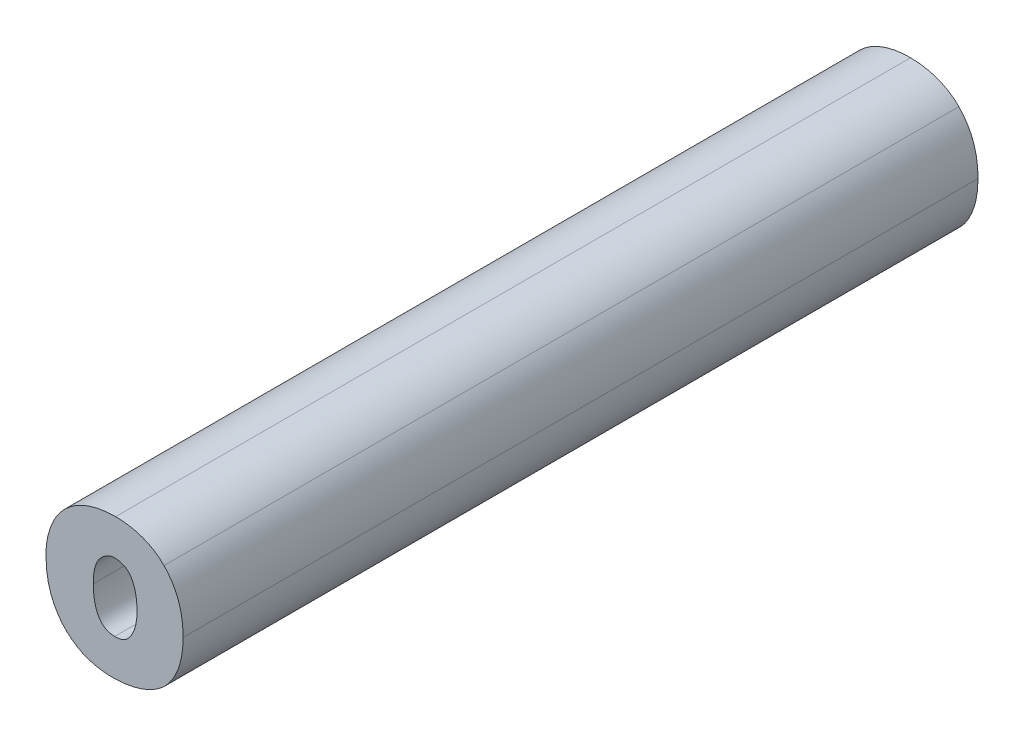
ISO-10303-21;
HEADER;
FILE_DESCRIPTION(('STEP AP214'),'2;1');
FILE_NAME('part.step','',(''),(''),'','','');
FILE_SCHEMA(('AUTOMOTIVE_DESIGN { 1 0 10303 214 1 1 1 1 }'));
ENDSEC;
DATA;
#1=APPLICATION_CONTEXT('core data for automotive mechanical design processes');
#2=APPLICATION_PROTOCOL_DEFINITION('international standard','automotive_design',2000,#1);
#3=PRODUCT_CONTEXT('',#1,'mechanical');
#4=PRODUCT('Part','Part','',(#3));
#5=PRODUCT_RELATED_PRODUCT_CATEGORY('part','',(#4));
#6=PRODUCT_DEFINITION_FORMATION('','',#4);
#7=PRODUCT_DEFINITION_CONTEXT('part definition',#1,'design');
#8=PRODUCT_DEFINITION('design','',#6,#7);
#9=PRODUCT_DEFINITION_SHAPE('','',#8);
#10=(LENGTH_UNIT() NAMED_UNIT(*) SI_UNIT(.MILLI.,.METRE.));
#11=(NAMED_UNIT(*) PLANE_ANGLE_UNIT() SI_UNIT($,.RADIAN.));
#12=(NAMED_UNIT(*) SI_UNIT($,.STERADIAN.) SOLID_ANGLE_UNIT());
#13=UNCERTAINTY_MEASURE_WITH_UNIT(LENGTH_MEASURE(1.E-05),#10,'distance_accuracy_value','');
#14=(GEOMETRIC_REPRESENTATION_CONTEXT(3) GLOBAL_UNCERTAINTY_ASSIGNED_CONTEXT((#13)) GLOBAL_UNIT_ASSIGNED_CONTEXT((#10,
#11,#12)) REPRESENTATION_CONTEXT('',''));
#15=CARTESIAN_POINT('',(0.,0.,0.));
#16=DIRECTION('',(0.,0.,1.));
#17=DIRECTION('',(1.,0.,0.));
#18=AXIS2_PLACEMENT_3D('',#15,#16,#17);
#19=CARTESIAN_POINT('',(1.3978509286736,0.0214916953246287,0.));
#20=CARTESIAN_POINT('',(1.3978509286736,0.0214916953246287,0.1));
#21=CARTESIAN_POINT('',(1.3985178231572,0.0214916953246297,0.));
#22=CARTESIAN_POINT('',(1.3985178231572,0.0214916953246297,0.1));
#23=CARTESIAN_POINT('',(1.3991557262079,0.0216656658089587,0.));
#24=CARTESIAN_POINT('',(1.3991557262079,0.0216656658089587,0.1));
#25=CARTESIAN_POINT('',(1.3995616679496,0.0221469920412952,0.));
#26=CARTESIAN_POINT('',(1.3995616679496,0.0221469920412952,0.1));
#27=B_SPLINE_SURFACE_WITH_KNOTS('',3,1,((#19,#20),(#21,#22),(#23,#24),(#25,#26)),.UNSPECIFIED.,
.F.,.F.,.F.,(4,4),(2,2),(-1.,0.),(0.,0.01),.UNSPECIFIED.);
#28=CARTESIAN_POINT('',(1.3978509286736,0.0214916953246287,0.));
#29=CARTESIAN_POINT('',(1.3985178231572,0.0214916953246297,0.));
#30=CARTESIAN_POINT('',(1.3991557262079,0.0216656658089587,0.));
#31=CARTESIAN_POINT('',(1.3995616679496,0.0221469920412952,0.));
#32=B_SPLINE_CURVE_WITH_KNOTS('',3,(#28,#29,#30,#31),.UNSPECIFIED.,.F.,.F.,(4,4),(-1.,0.),.UNSPECIFIED.);
#33=CARTESIAN_POINT('',(1.3978509286736,0.0214916953246287,0.));
#34=VERTEX_POINT('',#33);
#35=CARTESIAN_POINT('',(1.3995616679496,0.0221469920412952,0.));
#36=VERTEX_POINT('',#35);
#37=EDGE_CURVE('E11',#34,#36,#32,.T.);
#38=DIRECTION('',(0.,0.,1.));
#39=VECTOR('',#38,1.);
#40=CARTESIAN_POINT('',(1.3978509286736,0.0214916953246287,0.));
#41=LINE('',#40,#39);
#42=CARTESIAN_POINT('',(1.3978509286736,0.0214916953246287,0.1));
#43=VERTEX_POINT('',#42);
#44=EDGE_CURVE('E28',#34,#43,#41,.T.);
#45=CARTESIAN_POINT('',(1.3995616679496,0.0221469920412952,0.1));
#46=CARTESIAN_POINT('',(1.3991557262079,0.0216656658089587,0.1));
#47=CARTESIAN_POINT('',(1.3985178231572,0.0214916953246297,0.1));
#48=CARTESIAN_POINT('',(1.3978509286736,0.0214916953246287,0.1));
#49=B_SPLINE_CURVE_WITH_KNOTS('',3,(#45,#46,#47,#48),.UNSPECIFIED.,.F.,.F.,(4,4),(0.,1.),.UNSPECIFIED.);
#50=CARTESIAN_POINT('',(1.3995616679496,0.0221469920412952,0.1));
#51=VERTEX_POINT('',#50);
#52=EDGE_CURVE('E389',#51,#43,#49,.T.);
#53=DIRECTION('',(0.,0.,1.));
#54=VECTOR('',#53,1.);
#55=CARTESIAN_POINT('',(1.3995616679496,0.0221469920412952,0.));
#56=LINE('',#55,#54);
#57=EDGE_CURVE('E41',#36,#51,#56,.T.);
#58=ORIENTED_EDGE('',*,*,#37,.F.);
#59=ORIENTED_EDGE('',*,*,#44,.T.);
#60=ORIENTED_EDGE('',*,*,#52,.F.);
#61=ORIENTED_EDGE('',*,*,#57,.F.);
#62=EDGE_LOOP('',(#58,#59,#60,#61));
#63=FACE_BOUND('',#62,.T.);
#64=ADVANCED_FACE('F17',(#63),#27,.F.);
#65=CARTESIAN_POINT('',(1.3951543493576,0.0258787133476287,0.));
#66=CARTESIAN_POINT('',(1.3951543493576,0.0258787133476287,0.1));
#67=CARTESIAN_POINT('',(1.3951543493576,0.0242375686322922,0.));
#68=CARTESIAN_POINT('',(1.3951543493576,0.0242375686322922,0.1));
#69=CARTESIAN_POINT('',(1.3955312917076,0.0214916953246297,0.));
#70=CARTESIAN_POINT('',(1.3955312917076,0.0214916953246297,0.1));
#71=CARTESIAN_POINT('',(1.3978509286736,0.0214916953246287,0.));
#72=CARTESIAN_POINT('',(1.3978509286736,0.0214916953246287,0.1));
#73=B_SPLINE_SURFACE_WITH_KNOTS('',3,1,((#65,#66),(#67,#68),(#69,#70),(#71,#72)),.UNSPECIFIED.,
.F.,.F.,.F.,(4,4),(2,2),(-1.,0.),(0.,0.01),.UNSPECIFIED.);
#74=CARTESIAN_POINT('',(1.3951543493576,0.0258787133476287,0.));
#75=CARTESIAN_POINT('',(1.3951543493576,0.0242375686322922,0.));
#76=CARTESIAN_POINT('',(1.3955312917076,0.0214916953246297,0.));
#77=CARTESIAN_POINT('',(1.3978509286736,0.0214916953246287,0.));
#78=B_SPLINE_CURVE_WITH_KNOTS('',3,(#74,#75,#76,#77),.UNSPECIFIED.,.F.,.F.,(4,4),(-1.,0.),.UNSPECIFIED.);
#79=CARTESIAN_POINT('',(1.3951543493576,0.0258787133476287,0.));
#80=VERTEX_POINT('',#79);
#81=EDGE_CURVE('E380',#80,#34,#78,.T.);
#82=DIRECTION('',(0.,0.,1.));
#83=VECTOR('',#82,1.);
#84=CARTESIAN_POINT('',(1.3951543493576,0.0258787133476287,0.));
#85=LINE('',#84,#83);
#86=CARTESIAN_POINT('',(1.3951543493576,0.0258787133476287,0.1));
#87=VERTEX_POINT('',#86);
#88=EDGE_CURVE('E374',#80,#87,#85,.T.);
#89=CARTESIAN_POINT('',(1.3978509286736,0.0214916953246287,0.1));
#90=CARTESIAN_POINT('',(1.3955312917076,0.0214916953246297,0.1));
#91=CARTESIAN_POINT('',(1.3951543493576,0.0242375686322922,0.1));
#92=CARTESIAN_POINT('',(1.3951543493576,0.0258787133476287,0.1));
#93=B_SPLINE_CURVE_WITH_KNOTS('',3,(#89,#90,#91,#92),.UNSPECIFIED.,.F.,.F.,(4,4),(0.,1.),.UNSPECIFIED.);
#94=EDGE_CURVE('E367',#43,#87,#93,.T.);
#95=ORIENTED_EDGE('',*,*,#81,.F.);
#96=ORIENTED_EDGE('',*,*,#88,.T.);
#97=ORIENTED_EDGE('',*,*,#94,.F.);
#98=ORIENTED_EDGE('',*,*,#44,.F.);
#99=EDGE_LOOP('',(#95,#96,#97,#98));
#100=FACE_BOUND('',#99,.T.);
#101=ADVANCED_FACE('F395',(#100),#73,.F.);
#102=CARTESIAN_POINT('',(1.3964591449023,0.0295118546292952,0.));
#103=CARTESIAN_POINT('',(1.3964591449023,0.0295118546292952,0.1));
#104=CARTESIAN_POINT('',(1.3957052621918,0.0289000440672993,0.));
#105=CARTESIAN_POINT('',(1.3957052621918,0.0289000440672993,0.1));
#106=CARTESIAN_POINT('',(1.3951543493576,0.0279692899386336,0.));
#107=CARTESIAN_POINT('',(1.3951543493576,0.0279692899386336,0.1));
#108=CARTESIAN_POINT('',(1.3951543493576,0.0258787133476287,0.));
#109=CARTESIAN_POINT('',(1.3951543493576,0.0258787133476287,0.1));
#110=B_SPLINE_SURFACE_WITH_KNOTS('',3,1,((#102,#103),(#104,#105),(#106,#107),(#108,#109)),
.UNSPECIFIED.,.F.,.F.,.F.,(4,4),(2,2),(-1.,0.),(0.,0.01),.UNSPECIFIED.);
#111=CARTESIAN_POINT('',(1.3964591449023,0.0295118546292952,0.));
#112=CARTESIAN_POINT('',(1.3957052621918,0.0289000440672993,0.));
#113=CARTESIAN_POINT('',(1.3951543493576,0.0279692899386336,0.));
#114=CARTESIAN_POINT('',(1.3951543493576,0.0258787133476287,0.));
#115=B_SPLINE_CURVE_WITH_KNOTS('',3,(#111,#112,#113,#114),.UNSPECIFIED.,.F.,.F.,(4,4),(-1.,0.),.UNSPECIFIED.);
#116=CARTESIAN_POINT('',(1.3964591449023,0.0295118546292952,0.));
#117=VERTEX_POINT('',#116);
#118=EDGE_CURVE('E362',#117,#80,#115,.T.);
#119=DIRECTION('',(0.,0.,1.));
#120=VECTOR('',#119,1.);
#121=CARTESIAN_POINT('',(1.3964591449023,0.0295118546292952,0.));
#122=LINE('',#121,#120);
#123=CARTESIAN_POINT('',(1.3964591449023,0.0295118546292952,0.1));
#124=VERTEX_POINT('',#123);
#125=EDGE_CURVE('E356',#117,#124,#122,.T.);
#126=CARTESIAN_POINT('',(1.3951543493576,0.0258787133476287,0.1));
#127=CARTESIAN_POINT('',(1.3951543493576,0.0279692899386336,0.1));
#128=CARTESIAN_POINT('',(1.3957052621918,0.0289000440672993,0.1));
#129=CARTESIAN_POINT('',(1.3964591449023,0.0295118546292952,0.1));
#130=B_SPLINE_CURVE_WITH_KNOTS('',3,(#126,#127,#128,#129),.UNSPECIFIED.,.F.,.F.,(4,4),(0.,1.),.UNSPECIFIED.);
#131=EDGE_CURVE('E349',#87,#124,#130,.T.);
#132=ORIENTED_EDGE('',*,*,#118,.F.);
#133=ORIENTED_EDGE('',*,*,#125,.T.);
#134=ORIENTED_EDGE('',*,*,#131,.F.);
#135=ORIENTED_EDGE('',*,*,#88,.F.);
#136=EDGE_LOOP('',(#132,#133,#134,#135));
#137=FACE_BOUND('',#136,.T.);
#138=ADVANCED_FACE('F408',(#137),#110,.F.);
#139=CARTESIAN_POINT('',(1.3978799220963,0.0300598685192742,0.));
#140=CARTESIAN_POINT('',(1.3978799220963,0.0300598685192742,0.1));
#141=CARTESIAN_POINT('',(1.3971550427569,0.0300598685084712,0.));
#142=CARTESIAN_POINT('',(1.3971550427569,0.0300598685084712,0.1));
#143=CARTESIAN_POINT('',(1.3966331153928,0.0296394280580503,0.));
#144=CARTESIAN_POINT('',(1.3966331153928,0.0296394280580503,0.1));
#145=CARTESIAN_POINT('',(1.3964591449023,0.0295118546292952,0.));
#146=CARTESIAN_POINT('',(1.3964591449023,0.0295118546292952,0.1));
#147=B_SPLINE_SURFACE_WITH_KNOTS('',3,1,((#139,#140),(#141,#142),(#143,#144),(#145,#146)),
.UNSPECIFIED.,.F.,.F.,.F.,(4,4),(2,2),(-1.,0.),(0.,0.01),.UNSPECIFIED.);
#148=CARTESIAN_POINT('',(1.3978799220963,0.0300598685192742,0.));
#149=CARTESIAN_POINT('',(1.3971550427569,0.0300598685084712,0.));
#150=CARTESIAN_POINT('',(1.3966331153928,0.0296394280580503,0.));
#151=CARTESIAN_POINT('',(1.3964591449023,0.0295118546292952,0.));
#152=B_SPLINE_CURVE_WITH_KNOTS('',3,(#148,#149,#150,#151),.UNSPECIFIED.,.F.,.F.,(4,4),(-1.,0.),.UNSPECIFIED.);
#153=CARTESIAN_POINT('',(1.3978799220963,0.0300598685192742,0.));
#154=VERTEX_POINT('',#153);
#155=EDGE_CURVE('E344',#154,#117,#152,.T.);
#156=DIRECTION('',(0.,0.,1.));
#157=VECTOR('',#156,1.);
#158=CARTESIAN_POINT('',(1.3978799220963,0.0300598685192742,0.));
#159=LINE('',#158,#157);
#160=CARTESIAN_POINT('',(1.3978799220963,0.0300598685192742,0.1));
#161=VERTEX_POINT('',#160);
#162=EDGE_CURVE('E338',#154,#161,#159,.T.);
#163=CARTESIAN_POINT('',(1.3964591449023,0.0295118546292952,0.1));
#164=CARTESIAN_POINT('',(1.3966331153928,0.0296394280580503,0.1));
#165=CARTESIAN_POINT('',(1.3971550427569,0.0300598685084712,0.1));
#166=CARTESIAN_POINT('',(1.3978799220963,0.0300598685192742,0.1));
#167=B_SPLINE_CURVE_WITH_KNOTS('',3,(#163,#164,#165,#166),.UNSPECIFIED.,.F.,.F.,(4,4),(0.,1.),.UNSPECIFIED.);
#168=EDGE_CURVE('E331',#124,#161,#167,.T.);
#169=ORIENTED_EDGE('',*,*,#155,.F.);
#170=ORIENTED_EDGE('',*,*,#162,.T.);
#171=ORIENTED_EDGE('',*,*,#168,.F.);
#172=ORIENTED_EDGE('',*,*,#125,.F.);
#173=EDGE_LOOP('',(#169,#170,#171,#172));
#174=FACE_BOUND('',#173,.T.);
#175=ADVANCED_FACE('F411',(#174),#147,.F.);
#176=CARTESIAN_POINT('',(1.3995616679496,0.0294393651036287,0.));
#177=CARTESIAN_POINT('',(1.3995616679496,0.0294393651036287,0.1));
#178=CARTESIAN_POINT('',(1.3990107531256,0.0299554806576282,0.));
#179=CARTESIAN_POINT('',(1.3990107531256,0.0299554806576282,0.1));
#180=CARTESIAN_POINT('',(1.3981698782092,0.0300598685192728,0.));
#181=CARTESIAN_POINT('',(1.3981698782092,0.0300598685192728,0.1));
#182=CARTESIAN_POINT('',(1.3978799220963,0.0300598685192742,0.));
#183=CARTESIAN_POINT('',(1.3978799220963,0.0300598685192742,0.1));
#184=B_SPLINE_SURFACE_WITH_KNOTS('',3,1,((#176,#177),(#178,#179),(#180,#181),(#182,#183)),
.UNSPECIFIED.,.F.,.F.,.F.,(4,4),(2,2),(-1.,0.),(0.,0.01),.UNSPECIFIED.);
#185=CARTESIAN_POINT('',(1.3995616679496,0.0294393651036287,0.));
#186=CARTESIAN_POINT('',(1.3990107531256,0.0299554806576282,0.));
#187=CARTESIAN_POINT('',(1.3981698782092,0.0300598685192728,0.));
#188=CARTESIAN_POINT('',(1.3978799220963,0.0300598685192742,0.));
#189=B_SPLINE_CURVE_WITH_KNOTS('',3,(#185,#186,#187,#188),.UNSPECIFIED.,.F.,.F.,(4,4),(-1.,0.),.UNSPECIFIED.);
#190=CARTESIAN_POINT('',(1.3995616679496,0.0294393651036287,0.));
#191=VERTEX_POINT('',#190);
#192=EDGE_CURVE('E326',#191,#154,#189,.T.);
#193=DIRECTION('',(0.,0.,1.));
#194=VECTOR('',#193,1.);
#195=CARTESIAN_POINT('',(1.3995616679496,0.0294393651036287,0.));
#196=LINE('',#195,#194);
#197=CARTESIAN_POINT('',(1.3995616679496,0.0294393651036287,0.1));
#198=VERTEX_POINT('',#197);
#199=EDGE_CURVE('E320',#191,#198,#196,.T.);
#200=CARTESIAN_POINT('',(1.3978799220963,0.0300598685192742,0.1));
#201=CARTESIAN_POINT('',(1.3981698782092,0.0300598685192728,0.1));
#202=CARTESIAN_POINT('',(1.3990107531256,0.0299554806576282,0.1));
#203=CARTESIAN_POINT('',(1.3995616679496,0.0294393651036287,0.1));
#204=B_SPLINE_CURVE_WITH_KNOTS('',3,(#200,#201,#202,#203),.UNSPECIFIED.,.F.,.F.,(4,4),(0.,1.),.UNSPECIFIED.);
#205=EDGE_CURVE('E313',#161,#198,#204,.T.);
#206=ORIENTED_EDGE('',*,*,#192,.F.);
#207=ORIENTED_EDGE('',*,*,#199,.T.);
#208=ORIENTED_EDGE('',*,*,#205,.F.);
#209=ORIENTED_EDGE('',*,*,#162,.F.);
#210=EDGE_LOOP('',(#206,#207,#208,#209));
#211=FACE_BOUND('',#210,.T.);
#212=ADVANCED_FACE('F415',(#211),#184,.F.);
#213=CARTESIAN_POINT('',(1.4006634956079,0.0257946320239617,0.));
#214=CARTESIAN_POINT('',(1.4006634956079,0.0257946320239617,0.1));
#215=CARTESIAN_POINT('',(1.4006634956079,0.0258903170836278,0.));
#216=CARTESIAN_POINT('',(1.4006634956079,0.0258903170836278,0.1));
#217=CARTESIAN_POINT('',(1.4006924930099,0.0282824435752925,0.));
#218=CARTESIAN_POINT('',(1.4006924930099,0.0282824435752925,0.1));
#219=CARTESIAN_POINT('',(1.3995616679496,0.0294393651036287,0.));
#220=CARTESIAN_POINT('',(1.3995616679496,0.0294393651036287,0.1));
#221=B_SPLINE_SURFACE_WITH_KNOTS('',3,1,((#213,#214),(#215,#216),(#217,#218),(#219,#220)),
.UNSPECIFIED.,.F.,.F.,.F.,(4,4),(2,2),(-1.,0.),(0.,0.01),.UNSPECIFIED.);
#222=CARTESIAN_POINT('',(1.4006634956079,0.0257946320239617,0.));
#223=CARTESIAN_POINT('',(1.4006634956079,0.0258903170836278,0.));
#224=CARTESIAN_POINT('',(1.4006924930099,0.0282824435752925,0.));
#225=CARTESIAN_POINT('',(1.3995616679496,0.0294393651036287,0.));
#226=B_SPLINE_CURVE_WITH_KNOTS('',3,(#222,#223,#224,#225),.UNSPECIFIED.,.F.,.F.,(4,4),(-1.,0.),.UNSPECIFIED.);
#227=CARTESIAN_POINT('',(1.4006634956079,0.0257946320239617,0.));
#228=VERTEX_POINT('',#227);
#229=EDGE_CURVE('E308',#228,#191,#226,.T.);
#230=DIRECTION('',(0.,0.,1.));
#231=VECTOR('',#230,1.);
#232=CARTESIAN_POINT('',(1.4006634956079,0.0257946320239617,0.));
#233=LINE('',#232,#231);
#234=CARTESIAN_POINT('',(1.4006634956079,0.0257946320239617,0.1));
#235=VERTEX_POINT('',#234);
#236=EDGE_CURVE('E302',#228,#235,#233,.T.);
#237=CARTESIAN_POINT('',(1.3995616679496,0.0294393651036287,0.1));
#238=CARTESIAN_POINT('',(1.4006924930099,0.0282824435752925,0.1));
#239=CARTESIAN_POINT('',(1.4006634956079,0.0258903170836278,0.1));
#240=CARTESIAN_POINT('',(1.4006634956079,0.0257946320239617,0.1));
#241=B_SPLINE_CURVE_WITH_KNOTS('',3,(#237,#238,#239,#240),.UNSPECIFIED.,.F.,.F.,(4,4),(0.,1.),.UNSPECIFIED.);
#242=EDGE_CURVE('E295',#198,#235,#241,.T.);
#243=ORIENTED_EDGE('',*,*,#229,.F.);
#244=ORIENTED_EDGE('',*,*,#236,.T.);
#245=ORIENTED_EDGE('',*,*,#242,.F.);
#246=ORIENTED_EDGE('',*,*,#199,.F.);
#247=EDGE_LOOP('',(#243,#244,#245,#246));
#248=FACE_BOUND('',#247,.T.);
#249=ADVANCED_FACE('F417',(#248),#221,.F.);
#250=CARTESIAN_POINT('',(1.3995616679496,0.0221469920412952,0.));
#251=CARTESIAN_POINT('',(1.3995616679496,0.0221469920412952,0.1));
#252=CARTESIAN_POINT('',(1.4001125768045,0.0227587966342965,0.));
#253=CARTESIAN_POINT('',(1.4001125768045,0.0227587966342965,0.1));
#254=CARTESIAN_POINT('',(1.4006924930099,0.0238635311956262,0.));
#255=CARTESIAN_POINT('',(1.4006924930099,0.0238635311956262,0.1));
#256=CARTESIAN_POINT('',(1.4006634956079,0.0257946320239617,0.));
#257=CARTESIAN_POINT('',(1.4006634956079,0.0257946320239617,0.1));
#258=B_SPLINE_SURFACE_WITH_KNOTS('',3,1,((#250,#251),(#252,#253),(#254,#255),(#256,#257)),
.UNSPECIFIED.,.F.,.F.,.F.,(4,4),(2,2),(-1.,0.),(0.,0.01),.UNSPECIFIED.);
#259=CARTESIAN_POINT('',(1.3995616679496,0.0221469920412952,0.));
#260=CARTESIAN_POINT('',(1.4001125768045,0.0227587966342965,0.));
#261=CARTESIAN_POINT('',(1.4006924930099,0.0238635311956262,0.));
#262=CARTESIAN_POINT('',(1.4006634956079,0.0257946320239617,0.));
#263=B_SPLINE_CURVE_WITH_KNOTS('',3,(#259,#260,#261,#262),.UNSPECIFIED.,.F.,.F.,(4,4),(-1.,0.),.UNSPECIFIED.);
#264=EDGE_CURVE('E287',#36,#228,#263,.T.);
#265=CARTESIAN_POINT('',(1.4006634956079,0.0257946320239617,0.1));
#266=CARTESIAN_POINT('',(1.4006924930099,0.0238635311956262,0.1));
#267=CARTESIAN_POINT('',(1.4001125768045,0.0227587966342965,0.1));
#268=CARTESIAN_POINT('',(1.3995616679496,0.0221469920412952,0.1));
#269=B_SPLINE_CURVE_WITH_KNOTS('',3,(#265,#266,#267,#268),.UNSPECIFIED.,.F.,.F.,(4,4),(0.,1.),.UNSPECIFIED.);
#270=EDGE_CURVE('E279',#235,#51,#269,.T.);
#271=ORIENTED_EDGE('',*,*,#264,.F.);
#272=ORIENTED_EDGE('',*,*,#57,.T.);
#273=ORIENTED_EDGE('',*,*,#270,.F.);
#274=ORIENTED_EDGE('',*,*,#236,.F.);
#275=EDGE_LOOP('',(#271,#272,#273,#274));
#276=FACE_BOUND('',#275,.T.);
#277=ADVANCED_FACE('F401',(#276),#258,.F.);
#278=CARTESIAN_POINT('',(1.3912689521669,0.0196011916549742,0.));
#279=CARTESIAN_POINT('',(1.3912689521669,0.0196011916549742,0.1));
#280=CARTESIAN_POINT('',(1.3935016062784,0.0169625952049727,0.));
#281=CARTESIAN_POINT('',(1.3935016062784,0.0169625952049727,0.1));
#282=CARTESIAN_POINT('',(1.3965461271599,0.016898804501975,0.));
#283=CARTESIAN_POINT('',(1.3965461271599,0.016898804501975,0.1));
#284=CARTESIAN_POINT('',(1.3976479607873,0.0168988045019742,0.));
#285=CARTESIAN_POINT('',(1.3976479607873,0.0168988045019742,0.1));
#286=B_SPLINE_SURFACE_WITH_KNOTS('',3,1,((#278,#279),(#280,#281),(#282,#283),(#284,#285)),
.UNSPECIFIED.,.F.,.F.,.F.,(4,4),(2,2),(-1.,0.),(0.,0.01),.UNSPECIFIED.);
#287=CARTESIAN_POINT('',(1.3976479607873,0.0168988045019742,0.));
#288=CARTESIAN_POINT('',(1.3965461271599,0.016898804501975,0.));
#289=CARTESIAN_POINT('',(1.3935016062784,0.0169625952049727,0.));
#290=CARTESIAN_POINT('',(1.3912689521669,0.0196011916549742,0.));
#291=B_SPLINE_CURVE_WITH_KNOTS('',3,(#287,#288,#289,#290),.UNSPECIFIED.,.F.,.F.,(4,4),(0.,1.),.UNSPECIFIED.);
#292=CARTESIAN_POINT('',(1.3976479607873,0.0168988045019742,0.));
#293=VERTEX_POINT('',#292);
#294=CARTESIAN_POINT('',(1.3912689521669,0.0196011916549742,0.));
#295=VERTEX_POINT('',#294);
#296=EDGE_CURVE('E275',#293,#295,#291,.T.);
#297=DIRECTION('',(0.,0.,1.));
#298=VECTOR('',#297,1.);
#299=CARTESIAN_POINT('',(1.3976479607873,0.0168988045019742,0.));
#300=LINE('',#299,#298);
#301=CARTESIAN_POINT('',(1.3976479607873,0.0168988045019742,0.1));
#302=VERTEX_POINT('',#301);
#303=EDGE_CURVE('E270',#293,#302,#300,.T.);
#304=CARTESIAN_POINT('',(1.3912689521669,0.0196011916549742,0.1));
#305=CARTESIAN_POINT('',(1.3935016062784,0.0169625952049727,0.1));
#306=CARTESIAN_POINT('',(1.3965461271599,0.016898804501975,0.1));
#307=CARTESIAN_POINT('',(1.3976479607873,0.0168988045019742,0.1));
#308=B_SPLINE_CURVE_WITH_KNOTS('',3,(#304,#305,#306,#307),.UNSPECIFIED.,.F.,.F.,(4,4),(-1.,0.),.UNSPECIFIED.);
#309=CARTESIAN_POINT('',(1.3912689521669,0.0196011916549742,0.1));
#310=VERTEX_POINT('',#309);
#311=EDGE_CURVE('E153',#310,#302,#308,.T.);
#312=DIRECTION('',(0.,0.,1.));
#313=VECTOR('',#312,1.);
#314=CARTESIAN_POINT('',(1.3912689521669,0.0196011916549742,0.));
#315=LINE('',#314,#313);
#316=EDGE_CURVE('E261',#295,#310,#315,.T.);
#317=ORIENTED_EDGE('',*,*,#296,.F.);
#318=ORIENTED_EDGE('',*,*,#303,.T.);
#319=ORIENTED_EDGE('',*,*,#311,.F.);
#320=ORIENTED_EDGE('',*,*,#316,.F.);
#321=EDGE_LOOP('',(#317,#318,#319,#320));
#322=FACE_BOUND('',#321,.T.);
#323=ADVANCED_FACE('F425',(#322),#286,.T.);
#324=CARTESIAN_POINT('',(1.3892102685398,0.0259425000712952,0.));
#325=CARTESIAN_POINT('',(1.3892102685398,0.0259425000712952,0.1));
#326=CARTESIAN_POINT('',(1.3892102684768,0.0225935249292419,0.));
#327=CARTESIAN_POINT('',(1.3892102684768,0.0225935249292419,0.1));
#328=CARTESIAN_POINT('',(1.3903410893981,0.0207262108484068,0.));
#329=CARTESIAN_POINT('',(1.3903410893981,0.0207262108484068,0.1));
#330=CARTESIAN_POINT('',(1.3912689521669,0.0196011916549742,0.));
#331=CARTESIAN_POINT('',(1.3912689521669,0.0196011916549742,0.1));
#332=B_SPLINE_SURFACE_WITH_KNOTS('',3,1,((#324,#325),(#326,#327),(#328,#329),(#330,#331)),
.UNSPECIFIED.,.F.,.F.,.F.,(4,4),(2,2),(-1.,0.),(0.,0.01),.UNSPECIFIED.);
#333=CARTESIAN_POINT('',(1.3912689521669,0.0196011916549742,0.));
#334=CARTESIAN_POINT('',(1.3903410893981,0.0207262108484068,0.));
#335=CARTESIAN_POINT('',(1.3892102684768,0.0225935249292419,0.));
#336=CARTESIAN_POINT('',(1.3892102685398,0.0259425000712952,0.));
#337=B_SPLINE_CURVE_WITH_KNOTS('',3,(#333,#334,#335,#336),.UNSPECIFIED.,.F.,.F.,(4,4),(0.,1.),.UNSPECIFIED.);
#338=CARTESIAN_POINT('',(1.3892102685398,0.0259425000712952,0.));
#339=VERTEX_POINT('',#338);
#340=EDGE_CURVE('E254',#295,#339,#337,.T.);
#341=CARTESIAN_POINT('',(1.3892102685398,0.0259425000712952,0.1));
#342=CARTESIAN_POINT('',(1.3892102684768,0.0225935249292419,0.1));
#343=CARTESIAN_POINT('',(1.3903410893981,0.0207262108484068,0.1));
#344=CARTESIAN_POINT('',(1.3912689521669,0.0196011916549742,0.1));
#345=B_SPLINE_CURVE_WITH_KNOTS('',3,(#341,#342,#343,#344),.UNSPECIFIED.,.F.,.F.,(4,4),(-1.,0.),.UNSPECIFIED.);
#346=CARTESIAN_POINT('',(1.3892102685398,0.0259425000712952,0.1));
#347=VERTEX_POINT('',#346);
#348=EDGE_CURVE('E250',#347,#310,#345,.T.);
#349=DIRECTION('',(0.,0.,1.));
#350=VECTOR('',#349,1.);
#351=CARTESIAN_POINT('',(1.3892102685398,0.0259425000712952,0.));
#352=LINE('',#351,#350);
#353=EDGE_CURVE('E244',#339,#347,#352,.T.);
#354=ORIENTED_EDGE('',*,*,#340,.F.);
#355=ORIENTED_EDGE('',*,*,#316,.T.);
#356=ORIENTED_EDGE('',*,*,#348,.F.);
#357=ORIENTED_EDGE('',*,*,#353,.F.);
#358=EDGE_LOOP('',(#354,#355,#356,#357));
#359=FACE_BOUND('',#358,.T.);
#360=ADVANCED_FACE('F503',(#359),#332,.T.);
#361=CARTESIAN_POINT('',(1.389761182568,0.0292885861739617,0.));
#362=CARTESIAN_POINT('',(1.389761182568,0.0292885861739617,0.1));
#363=CARTESIAN_POINT('',(1.3892102685398,0.0278417065429622,0.));
#364=CARTESIAN_POINT('',(1.3892102685398,0.0278417065429622,0.1));
#365=CARTESIAN_POINT('',(1.3892102685398,0.0265224162766327,0.));
#366=CARTESIAN_POINT('',(1.3892102685398,0.0265224162766327,0.1));
#367=CARTESIAN_POINT('',(1.3892102685398,0.0259425000712952,0.));
#368=CARTESIAN_POINT('',(1.3892102685398,0.0259425000712952,0.1));
#369=B_SPLINE_SURFACE_WITH_KNOTS('',3,1,((#361,#362),(#363,#364),(#365,#366),(#367,#368)),
.UNSPECIFIED.,.F.,.F.,.F.,(4,4),(2,2),(-1.,0.),(0.,0.01),.UNSPECIFIED.);
#370=CARTESIAN_POINT('',(1.3892102685398,0.0259425000712952,0.));
#371=CARTESIAN_POINT('',(1.3892102685398,0.0265224162766327,0.));
#372=CARTESIAN_POINT('',(1.3892102685398,0.0278417065429622,0.));
#373=CARTESIAN_POINT('',(1.389761182568,0.0292885861739617,0.));
#374=B_SPLINE_CURVE_WITH_KNOTS('',3,(#370,#371,#372,#373),.UNSPECIFIED.,.F.,.F.,(4,4),(0.,1.),.UNSPECIFIED.);
#375=CARTESIAN_POINT('',(1.389761182568,0.0292885861739617,0.));
#376=VERTEX_POINT('',#375);
#377=EDGE_CURVE('E237',#339,#376,#374,.T.);
#378=CARTESIAN_POINT('',(1.389761182568,0.0292885861739617,0.1));
#379=CARTESIAN_POINT('',(1.3892102685398,0.0278417065429622,0.1));
#380=CARTESIAN_POINT('',(1.3892102685398,0.0265224162766327,0.1));
#381=CARTESIAN_POINT('',(1.3892102685398,0.0259425000712952,0.1));
#382=B_SPLINE_CURVE_WITH_KNOTS('',3,(#378,#379,#380,#381),.UNSPECIFIED.,.F.,.F.,(4,4),(-1.,0.),.UNSPECIFIED.);
#383=CARTESIAN_POINT('',(1.389761182568,0.0292885861739617,0.1));
#384=VERTEX_POINT('',#383);
#385=EDGE_CURVE('E232',#384,#347,#382,.T.);
#386=DIRECTION('',(0.,0.,1.));
#387=VECTOR('',#386,1.);
#388=CARTESIAN_POINT('',(1.389761182568,0.0292885861739617,0.));
#389=LINE('',#388,#387);
#390=EDGE_CURVE('E226',#376,#384,#389,.T.);
#391=ORIENTED_EDGE('',*,*,#377,.F.);
#392=ORIENTED_EDGE('',*,*,#353,.T.);
#393=ORIENTED_EDGE('',*,*,#385,.F.);
#394=ORIENTED_EDGE('',*,*,#390,.F.);
#395=EDGE_LOOP('',(#391,#392,#393,#394));
#396=FACE_BOUND('',#395,.T.);
#397=ADVANCED_FACE('F513',(#396),#369,.T.);
#398=CARTESIAN_POINT('',(1.3979669103229,0.0345976654719742,0.));
#399=CARTESIAN_POINT('',(1.3979669103229,0.0345976654719742,0.1));
#400=CARTESIAN_POINT('',(1.3944004666473,0.0346295578389776,0.));
#401=CARTESIAN_POINT('',(1.3944004666473,0.0346295578389776,0.1));
#402=CARTESIAN_POINT('',(1.3910079938538,0.0329565147876228,0.));
#403=CARTESIAN_POINT('',(1.3910079938538,0.0329565147876228,0.1));
#404=CARTESIAN_POINT('',(1.389761182568,0.0292885861739617,0.));
#405=CARTESIAN_POINT('',(1.389761182568,0.0292885861739617,0.1));
#406=B_SPLINE_SURFACE_WITH_KNOTS('',3,1,((#398,#399),(#400,#401),(#402,#403),(#404,#405)),
.UNSPECIFIED.,.F.,.F.,.F.,(4,4),(2,2),(-1.,0.),(0.,0.01),.UNSPECIFIED.);
#407=CARTESIAN_POINT('',(1.389761182568,0.0292885861739617,0.));
#408=CARTESIAN_POINT('',(1.3910079938538,0.0329565147876228,0.));
#409=CARTESIAN_POINT('',(1.3944004666473,0.0346295578389776,0.));
#410=CARTESIAN_POINT('',(1.3979669103229,0.0345976654719742,0.));
#411=B_SPLINE_CURVE_WITH_KNOTS('',3,(#407,#408,#409,#410),.UNSPECIFIED.,.F.,.F.,(4,4),(0.,1.),.UNSPECIFIED.);
#412=CARTESIAN_POINT('',(1.3979669103229,0.0345976654719742,0.));
#413=VERTEX_POINT('',#412);
#414=EDGE_CURVE('E219',#376,#413,#411,.T.);
#415=CARTESIAN_POINT('',(1.3979669103229,0.0345976654719742,0.1));
#416=CARTESIAN_POINT('',(1.3944004666473,0.0346295578389776,0.1));
#417=CARTESIAN_POINT('',(1.3910079938538,0.0329565147876228,0.1));
#418=CARTESIAN_POINT('',(1.389761182568,0.0292885861739617,0.1));
#419=B_SPLINE_CURVE_WITH_KNOTS('',3,(#415,#416,#417,#418),.UNSPECIFIED.,.F.,.F.,(4,4),(-1.,0.),.UNSPECIFIED.);
#420=CARTESIAN_POINT('',(1.3979669103229,0.0345976654719742,0.1));
#421=VERTEX_POINT('',#420);
#422=EDGE_CURVE('E214',#421,#384,#419,.T.);
#423=DIRECTION('',(0.,0.,1.));
#424=VECTOR('',#423,1.);
#425=CARTESIAN_POINT('',(1.3979669103229,0.0345976654719742,0.));
#426=LINE('',#425,#424);
#427=EDGE_CURVE('E208',#413,#421,#426,.T.);
#428=ORIENTED_EDGE('',*,*,#414,.F.);
#429=ORIENTED_EDGE('',*,*,#390,.T.);
#430=ORIENTED_EDGE('',*,*,#422,.F.);
#431=ORIENTED_EDGE('',*,*,#427,.F.);
#432=EDGE_LOOP('',(#428,#429,#430,#431));
#433=FACE_BOUND('',#432,.T.);
#434=ADVANCED_FACE('F523',(#433),#406,.T.);
#435=CARTESIAN_POINT('',(1.4040559687993,0.0323128178276242,0.));
#436=CARTESIAN_POINT('',(1.4040559687993,0.0323128178276242,0.1));
#437=CARTESIAN_POINT('',(1.401910302319,0.0345019804710341,0.));
#438=CARTESIAN_POINT('',(1.401910302319,0.0345019804710341,0.1));
#439=CARTESIAN_POINT('',(1.398923764899,0.0345976654862332,0.));
#440=CARTESIAN_POINT('',(1.398923764899,0.0345976654862332,0.1));
#441=CARTESIAN_POINT('',(1.3979669103229,0.0345976654719742,0.));
#442=CARTESIAN_POINT('',(1.3979669103229,0.0345976654719742,0.1));
#443=B_SPLINE_SURFACE_WITH_KNOTS('',3,1,((#435,#436),(#437,#438),(#439,#440),(#441,#442)),
.UNSPECIFIED.,.F.,.F.,.F.,(4,4),(2,2),(-1.,0.),(0.,0.01),.UNSPECIFIED.);
#444=CARTESIAN_POINT('',(1.3979669103229,0.0345976654719742,0.));
#445=CARTESIAN_POINT('',(1.398923764899,0.0345976654862332,0.));
#446=CARTESIAN_POINT('',(1.401910302319,0.0345019804710341,0.));
#447=CARTESIAN_POINT('',(1.4040559687993,0.0323128178276242,0.));
#448=B_SPLINE_CURVE_WITH_KNOTS('',3,(#444,#445,#446,#447),.UNSPECIFIED.,.F.,.F.,(4,4),(0.,1.),.UNSPECIFIED.);
#449=CARTESIAN_POINT('',(1.4040559687993,0.0323128178276242,0.));
#450=VERTEX_POINT('',#449);
#451=EDGE_CURVE('E201',#413,#450,#448,.T.);
#452=CARTESIAN_POINT('',(1.4040559687993,0.0323128178276242,0.1));
#453=CARTESIAN_POINT('',(1.401910302319,0.0345019804710341,0.1));
#454=CARTESIAN_POINT('',(1.398923764899,0.0345976654862332,0.1));
#455=CARTESIAN_POINT('',(1.3979669103229,0.0345976654719742,0.1));
#456=B_SPLINE_CURVE_WITH_KNOTS('',3,(#452,#453,#454,#455),.UNSPECIFIED.,.F.,.F.,(4,4),(-1.,0.),.UNSPECIFIED.);
#457=CARTESIAN_POINT('',(1.4040559687993,0.0323128178276242,0.1));
#458=VERTEX_POINT('',#457);
#459=EDGE_CURVE('E196',#458,#421,#456,.T.);
#460=DIRECTION('',(0.,0.,1.));
#461=VECTOR('',#460,1.);
#462=CARTESIAN_POINT('',(1.4040559687993,0.0323128178276242,0.));
#463=LINE('',#462,#461);
#464=EDGE_CURVE('E190',#450,#458,#463,.T.);
#465=ORIENTED_EDGE('',*,*,#451,.F.);
#466=ORIENTED_EDGE('',*,*,#427,.T.);
#467=ORIENTED_EDGE('',*,*,#459,.F.);
#468=ORIENTED_EDGE('',*,*,#464,.F.);
#469=EDGE_LOOP('',(#465,#466,#467,#468));
#470=FACE_BOUND('',#469,.T.);
#471=ADVANCED_FACE('F533',(#470),#443,.T.);
#472=CARTESIAN_POINT('',(1.4064625979713,0.0256844482632952,0.));
#473=CARTESIAN_POINT('',(1.4064625979713,0.0256844482632952,0.1));
#474=CARTESIAN_POINT('',(1.4064915953732,0.0292247934812994,0.));
#475=CARTESIAN_POINT('',(1.4064915953732,0.0292247934812994,0.1));
#476=CARTESIAN_POINT('',(1.4051288030349,0.0312196870022718,0.));
#477=CARTESIAN_POINT('',(1.4051288030349,0.0312196870022718,0.1));
#478=CARTESIAN_POINT('',(1.4040559687993,0.0323128178276242,0.));
#479=CARTESIAN_POINT('',(1.4040559687993,0.0323128178276242,0.1));
#480=B_SPLINE_SURFACE_WITH_KNOTS('',3,1,((#472,#473),(#474,#475),(#476,#477),(#478,#479)),
.UNSPECIFIED.,.F.,.F.,.F.,(4,4),(2,2),(-1.,0.),(0.,0.01),.UNSPECIFIED.);
#481=CARTESIAN_POINT('',(1.4040559687993,0.0323128178276242,0.));
#482=CARTESIAN_POINT('',(1.4051288030349,0.0312196870022718,0.));
#483=CARTESIAN_POINT('',(1.4064915953732,0.0292247934812994,0.));
#484=CARTESIAN_POINT('',(1.4064625979713,0.0256844482632952,0.));
#485=B_SPLINE_CURVE_WITH_KNOTS('',3,(#481,#482,#483,#484),.UNSPECIFIED.,.F.,.F.,(4,4),(0.,1.),.UNSPECIFIED.);
#486=CARTESIAN_POINT('',(1.4064625979713,0.0256844482632952,0.));
#487=VERTEX_POINT('',#486);
#488=EDGE_CURVE('E183',#450,#487,#485,.T.);
#489=CARTESIAN_POINT('',(1.4064625979713,0.0256844482632952,0.1));
#490=CARTESIAN_POINT('',(1.4064915953732,0.0292247934812994,0.1));
#491=CARTESIAN_POINT('',(1.4051288030349,0.0312196870022718,0.1));
#492=CARTESIAN_POINT('',(1.4040559687993,0.0323128178276242,0.1));
#493=B_SPLINE_CURVE_WITH_KNOTS('',3,(#489,#490,#491,#492),.UNSPECIFIED.,.F.,.F.,(4,4),(-1.,0.),.UNSPECIFIED.);
#494=CARTESIAN_POINT('',(1.4064625979713,0.0256844482632952,0.1));
#495=VERTEX_POINT('',#494);
#496=EDGE_CURVE('E179',#495,#458,#493,.T.);
#497=DIRECTION('',(0.,0.,1.));
#498=VECTOR('',#497,1.);
#499=CARTESIAN_POINT('',(1.4064625979713,0.0256844482632952,0.));
#500=LINE('',#499,#498);
#501=EDGE_CURVE('E135',#487,#495,#500,.T.);
#502=ORIENTED_EDGE('',*,*,#488,.F.);
#503=ORIENTED_EDGE('',*,*,#464,.T.);
#504=ORIENTED_EDGE('',*,*,#496,.F.);
#505=ORIENTED_EDGE('',*,*,#501,.F.);
#506=EDGE_LOOP('',(#502,#503,#504,#505));
#507=FACE_BOUND('',#506,.T.);
#508=ADVANCED_FACE('F543',(#507),#480,.T.);
#509=CARTESIAN_POINT('',(1.4042009458609,0.0192793372059742,0.));
#510=CARTESIAN_POINT('',(1.4042009458609,0.0192793372059742,0.1));
#511=CARTESIAN_POINT('',(1.4064046071466,0.0215322904936268,0.));
#512=CARTESIAN_POINT('',(1.4064046071466,0.0215322904936268,0.1));
#513=CARTESIAN_POINT('',(1.4064625979712,0.0248174808582922,0.));
#514=CARTESIAN_POINT('',(1.4064625979712,0.0248174808582922,0.1));
#515=CARTESIAN_POINT('',(1.4064625979713,0.0256844482632952,0.));
#516=CARTESIAN_POINT('',(1.4064625979713,0.0256844482632952,0.1));
#517=B_SPLINE_SURFACE_WITH_KNOTS('',3,1,((#509,#510),(#511,#512),(#513,#514),(#515,#516)),
.UNSPECIFIED.,.F.,.F.,.F.,(4,4),(2,2),(-1.,0.),(0.,0.01),.UNSPECIFIED.);
#518=CARTESIAN_POINT('',(1.4064625979713,0.0256844482632952,0.));
#519=CARTESIAN_POINT('',(1.4064625979712,0.0248174808582922,0.));
#520=CARTESIAN_POINT('',(1.4064046071466,0.0215322904936268,0.));
#521=CARTESIAN_POINT('',(1.4042009458609,0.0192793372059742,0.));
#522=B_SPLINE_CURVE_WITH_KNOTS('',3,(#518,#519,#520,#521),.UNSPECIFIED.,.F.,.F.,(4,4),(0.,1.),.UNSPECIFIED.);
#523=CARTESIAN_POINT('',(1.4042009458609,0.0192793372059742,0.));
#524=VERTEX_POINT('',#523);
#525=EDGE_CURVE('E139',#487,#524,#522,.T.);
#526=CARTESIAN_POINT('',(1.4042009458609,0.0192793372059742,0.1));
#527=CARTESIAN_POINT('',(1.4064046071466,0.0215322904936268,0.1));
#528=CARTESIAN_POINT('',(1.4064625979712,0.0248174808582922,0.1));
#529=CARTESIAN_POINT('',(1.4064625979713,0.0256844482632952,0.1));
#530=B_SPLINE_CURVE_WITH_KNOTS('',3,(#526,#527,#528,#529),.UNSPECIFIED.,.F.,.F.,(4,4),(-1.,0.),.UNSPECIFIED.);
#531=CARTESIAN_POINT('',(1.4042009458609,0.0192793372059742,0.1));
#532=VERTEX_POINT('',#531);
#533=EDGE_CURVE('E128',#532,#495,#530,.T.);
#534=DIRECTION('',(0.,0.,1.));
#535=VECTOR('',#534,1.);
#536=CARTESIAN_POINT('',(1.4042009458609,0.0192793372059742,0.));
#537=LINE('',#536,#535);
#538=EDGE_CURVE('E132',#524,#532,#537,.T.);
#539=ORIENTED_EDGE('',*,*,#525,.F.);
#540=ORIENTED_EDGE('',*,*,#501,.T.);
#541=ORIENTED_EDGE('',*,*,#533,.F.);
#542=ORIENTED_EDGE('',*,*,#538,.F.);
#543=EDGE_LOOP('',(#539,#540,#541,#542));
#544=FACE_BOUND('',#543,.T.);
#545=ADVANCED_FACE('F131',(#544),#517,.T.);
#546=CARTESIAN_POINT('',(1.3976479607873,0.0168988045019742,0.));
#547=CARTESIAN_POINT('',(1.3976479607873,0.0168988045019742,0.1));
#548=CARTESIAN_POINT('',(1.4010984248032,0.016898804501975,0.));
#549=CARTESIAN_POINT('',(1.4010984248032,0.016898804501975,0.1));
#550=CARTESIAN_POINT('',(1.4031861044396,0.0182499970836254,0.));
#551=CARTESIAN_POINT('',(1.4031861044396,0.0182499970836254,0.1));
#552=CARTESIAN_POINT('',(1.4042009458609,0.0192793372059742,0.));
#553=CARTESIAN_POINT('',(1.4042009458609,0.0192793372059742,0.1));
#554=B_SPLINE_SURFACE_WITH_KNOTS('',3,1,((#546,#547),(#548,#549),(#550,#551),(#552,#553)),
.UNSPECIFIED.,.F.,.F.,.F.,(4,4),(2,2),(-1.,0.),(0.,0.01),.UNSPECIFIED.);
#555=CARTESIAN_POINT('',(1.4042009458609,0.0192793372059742,0.));
#556=CARTESIAN_POINT('',(1.4031861044396,0.0182499970836254,0.));
#557=CARTESIAN_POINT('',(1.4010984248032,0.016898804501975,0.));
#558=CARTESIAN_POINT('',(1.3976479607873,0.0168988045019742,0.));
#559=B_SPLINE_CURVE_WITH_KNOTS('',3,(#555,#556,#557,#558),.UNSPECIFIED.,.F.,.F.,(4,4),(0.,1.),.UNSPECIFIED.);
#560=EDGE_CURVE('E147',#524,#293,#559,.T.);
#561=CARTESIAN_POINT('',(1.3976479607873,0.0168988045019742,0.1));
#562=CARTESIAN_POINT('',(1.4010984248032,0.016898804501975,0.1));
#563=CARTESIAN_POINT('',(1.4031861044396,0.0182499970836254,0.1));
#564=CARTESIAN_POINT('',(1.4042009458609,0.0192793372059742,0.1));
#565=B_SPLINE_CURVE_WITH_KNOTS('',3,(#561,#562,#563,#564),.UNSPECIFIED.,.F.,.F.,(4,4),(-1.,0.),.UNSPECIFIED.);
#566=EDGE_CURVE('E145',#302,#532,#565,.T.);
#567=ORIENTED_EDGE('',*,*,#560,.F.);
#568=ORIENTED_EDGE('',*,*,#538,.T.);
#569=ORIENTED_EDGE('',*,*,#566,.F.);
#570=ORIENTED_EDGE('',*,*,#303,.F.);
#571=EDGE_LOOP('',(#567,#568,#569,#570));
#572=FACE_BOUND('',#571,.T.);
#573=ADVANCED_FACE('F143',(#572),#554,.T.);
#574=CARTESIAN_POINT('',(1.3978496239868,0.0257426141658833,0.));
#575=DIRECTION('',(0.,0.,1.));
#576=DIRECTION('',(1.,0.,0.));
#577=AXIS2_PLACEMENT_3D('',#574,#575,#576);
#578=PLANE('',#577);
#579=ORIENTED_EDGE('',*,*,#560,.T.);
#580=ORIENTED_EDGE('',*,*,#296,.T.);
#581=ORIENTED_EDGE('',*,*,#340,.T.);
#582=ORIENTED_EDGE('',*,*,#377,.T.);
#583=ORIENTED_EDGE('',*,*,#414,.T.);
#584=ORIENTED_EDGE('',*,*,#451,.T.);
#585=ORIENTED_EDGE('',*,*,#488,.T.);
#586=ORIENTED_EDGE('',*,*,#525,.T.);
#587=EDGE_LOOP('',(#579,#580,#581,#582,#583,#584,#585,#586));
#588=FACE_BOUND('',#587,.T.);
#589=ORIENTED_EDGE('',*,*,#37,.T.);
#590=ORIENTED_EDGE('',*,*,#264,.T.);
#591=ORIENTED_EDGE('',*,*,#229,.T.);
#592=ORIENTED_EDGE('',*,*,#192,.T.);
#593=ORIENTED_EDGE('',*,*,#155,.T.);
#594=ORIENTED_EDGE('',*,*,#118,.T.);
#595=ORIENTED_EDGE('',*,*,#81,.T.);
#596=EDGE_LOOP('',(#589,#590,#591,#592,#593,#594,#595));
#597=FACE_BOUND('',#596,.T.);
#598=ADVANCED_FACE('F404',(#588,#597),#578,.F.);
#599=CARTESIAN_POINT('',(1.3978496239868,0.0257426141658833,0.1));
#600=DIRECTION('',(0.,0.,1.));
#601=DIRECTION('',(1.,0.,0.));
#602=AXIS2_PLACEMENT_3D('',#599,#600,#601);
#603=PLANE('',#602);
#604=ORIENTED_EDGE('',*,*,#566,.T.);
#605=ORIENTED_EDGE('',*,*,#533,.T.);
#606=ORIENTED_EDGE('',*,*,#496,.T.);
#607=ORIENTED_EDGE('',*,*,#459,.T.);
#608=ORIENTED_EDGE('',*,*,#422,.T.);
#609=ORIENTED_EDGE('',*,*,#385,.T.);
#610=ORIENTED_EDGE('',*,*,#348,.T.);
#611=ORIENTED_EDGE('',*,*,#311,.T.);
#612=EDGE_LOOP('',(#604,#605,#606,#607,#608,#609,#610,#611));
#613=FACE_BOUND('',#612,.T.);
#614=ORIENTED_EDGE('',*,*,#52,.T.);
#615=ORIENTED_EDGE('',*,*,#94,.T.);
#616=ORIENTED_EDGE('',*,*,#131,.T.);
#617=ORIENTED_EDGE('',*,*,#168,.T.);
#618=ORIENTED_EDGE('',*,*,#205,.T.);
#619=ORIENTED_EDGE('',*,*,#242,.T.);
#620=ORIENTED_EDGE('',*,*,#270,.T.);
#621=EDGE_LOOP('',(#614,#615,#616,#617,#618,#619,#620));
#622=FACE_BOUND('',#621,.T.);
#623=ADVANCED_FACE('F150',(#613,#622),#603,.T.);
#624=CLOSED_SHELL('',(#64,#101,#138,#175,#212,#249,#277,#323,#360,#397,#434,#471,#508,#545,#573,
#598,#623));
#625=MANIFOLD_SOLID_BREP('B1',#624);
#626=ADVANCED_BREP_SHAPE_REPRESENTATION('',(#18,#625),#14);
#627=SHAPE_DEFINITION_REPRESENTATION(#9,#626);
ENDSEC;
END-ISO-10303-21;
